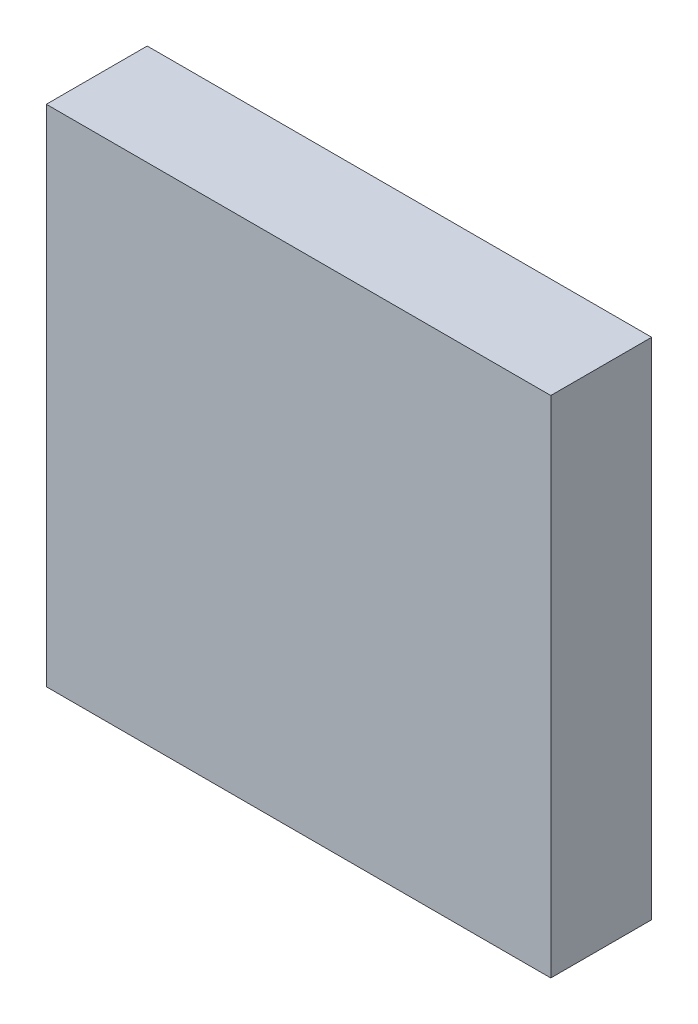
ISO-10303-21;
HEADER;
FILE_DESCRIPTION(('STEP AP214'),'2;1');
FILE_NAME('part.step','',(''),(''),'','','');
FILE_SCHEMA(('AUTOMOTIVE_DESIGN { 1 0 10303 214 1 1 1 1 }'));
ENDSEC;
DATA;
#1=APPLICATION_CONTEXT('core data for automotive mechanical design processes');
#2=APPLICATION_PROTOCOL_DEFINITION('international standard','automotive_design',2000,#1);
#3=PRODUCT_CONTEXT('',#1,'mechanical');
#4=PRODUCT('Part','Part','',(#3));
#5=PRODUCT_RELATED_PRODUCT_CATEGORY('part','',(#4));
#6=PRODUCT_DEFINITION_FORMATION('','',#4);
#7=PRODUCT_DEFINITION_CONTEXT('part definition',#1,'design');
#8=PRODUCT_DEFINITION('design','',#6,#7);
#9=PRODUCT_DEFINITION_SHAPE('','',#8);
#10=(LENGTH_UNIT() NAMED_UNIT(*) SI_UNIT(.MILLI.,.METRE.));
#11=(NAMED_UNIT(*) PLANE_ANGLE_UNIT() SI_UNIT($,.RADIAN.));
#12=(NAMED_UNIT(*) SI_UNIT($,.STERADIAN.) SOLID_ANGLE_UNIT());
#13=UNCERTAINTY_MEASURE_WITH_UNIT(LENGTH_MEASURE(1.E-05),#10,'distance_accuracy_value','');
#14=(GEOMETRIC_REPRESENTATION_CONTEXT(3) GLOBAL_UNCERTAINTY_ASSIGNED_CONTEXT((#13)) GLOBAL_UNIT_ASSIGNED_CONTEXT((#10,
#11,#12)) REPRESENTATION_CONTEXT('',''));
#15=CARTESIAN_POINT('',(0.,0.,0.));
#16=DIRECTION('',(0.,0.,1.));
#17=DIRECTION('',(1.,0.,0.));
#18=AXIS2_PLACEMENT_3D('',#15,#16,#17);
#19=CARTESIAN_POINT('',(-12.5,-12.5,5.));
#20=DIRECTION('',(0.,1.,0.));
#21=DIRECTION('',(-1.,0.,0.));
#22=AXIS2_PLACEMENT_3D('',#19,#20,#21);
#23=PLANE('',#22);
#24=DIRECTION('',(1.,0.,0.));
#25=VECTOR('',#24,1.);
#26=CARTESIAN_POINT('',(-12.5,-12.5,0.));
#27=LINE('',#26,#25);
#28=CARTESIAN_POINT('',(-12.5,-12.5,0.));
#29=VERTEX_POINT('',#28);
#30=CARTESIAN_POINT('',(12.5,-12.5,0.));
#31=VERTEX_POINT('',#30);
#32=EDGE_CURVE('E113',#29,#31,#27,.T.);
#33=ORIENTED_EDGE('',*,*,#32,.T.);
#34=DIRECTION('',(0.,0.,-1.));
#35=VECTOR('',#34,1.);
#36=CARTESIAN_POINT('',(12.5,-12.5,5.));
#37=LINE('',#36,#35);
#38=CARTESIAN_POINT('',(12.5,-12.5,5.));
#39=VERTEX_POINT('',#38);
#40=EDGE_CURVE('E11',#39,#31,#37,.T.);
#41=ORIENTED_EDGE('',*,*,#40,.F.);
#42=DIRECTION('',(1.,0.,0.));
#43=VECTOR('',#42,1.);
#44=CARTESIAN_POINT('',(-12.5,-12.5,5.));
#45=LINE('',#44,#43);
#46=CARTESIAN_POINT('',(-12.5,-12.5,5.));
#47=VERTEX_POINT('',#46);
#48=EDGE_CURVE('E97',#47,#39,#45,.T.);
#49=ORIENTED_EDGE('',*,*,#48,.F.);
#50=DIRECTION('',(0.,0.,-1.));
#51=VECTOR('',#50,1.);
#52=CARTESIAN_POINT('',(-12.5,-12.5,5.));
#53=LINE('',#52,#51);
#54=EDGE_CURVE('E109',#47,#29,#53,.T.);
#55=ORIENTED_EDGE('',*,*,#54,.T.);
#56=EDGE_LOOP('',(#33,#41,#49,#55));
#57=FACE_BOUND('',#56,.T.);
#58=ADVANCED_FACE('F45',(#57),#23,.F.);
#59=CARTESIAN_POINT('',(12.5,12.5,5.));
#60=DIRECTION('',(-1.,0.,0.));
#61=DIRECTION('',(0.,-1.,0.));
#62=AXIS2_PLACEMENT_3D('',#59,#60,#61);
#63=PLANE('',#62);
#64=DIRECTION('',(0.,1.,0.));
#65=VECTOR('',#64,1.);
#66=CARTESIAN_POINT('',(12.5,12.5,0.));
#67=LINE('',#66,#65);
#68=CARTESIAN_POINT('',(12.5,12.5,0.));
#69=VERTEX_POINT('',#68);
#70=EDGE_CURVE('E102',#31,#69,#67,.T.);
#71=ORIENTED_EDGE('',*,*,#70,.T.);
#72=DIRECTION('',(0.,0.,-1.));
#73=VECTOR('',#72,1.);
#74=CARTESIAN_POINT('',(12.5,12.5,5.));
#75=LINE('',#74,#73);
#76=CARTESIAN_POINT('',(12.5,12.5,5.));
#77=VERTEX_POINT('',#76);
#78=EDGE_CURVE('E54',#77,#69,#75,.T.);
#79=ORIENTED_EDGE('',*,*,#78,.F.);
#80=DIRECTION('',(0.,1.,0.));
#81=VECTOR('',#80,1.);
#82=CARTESIAN_POINT('',(12.5,12.5,5.));
#83=LINE('',#82,#81);
#84=EDGE_CURVE('E92',#39,#77,#83,.T.);
#85=ORIENTED_EDGE('',*,*,#84,.F.);
#86=ORIENTED_EDGE('',*,*,#40,.T.);
#87=EDGE_LOOP('',(#71,#79,#85,#86));
#88=FACE_BOUND('',#87,.T.);
#89=ADVANCED_FACE('F101',(#88),#63,.F.);
#90=CARTESIAN_POINT('',(-12.5,12.5,5.));
#91=DIRECTION('',(0.,-1.,0.));
#92=DIRECTION('',(1.,0.,0.));
#93=AXIS2_PLACEMENT_3D('',#90,#91,#92);
#94=PLANE('',#93);
#95=DIRECTION('',(-1.,0.,0.));
#96=VECTOR('',#95,1.);
#97=CARTESIAN_POINT('',(-12.5,12.5,0.));
#98=LINE('',#97,#96);
#99=CARTESIAN_POINT('',(-12.5,12.5,0.));
#100=VERTEX_POINT('',#99);
#101=EDGE_CURVE('E79',#69,#100,#98,.T.);
#102=ORIENTED_EDGE('',*,*,#101,.T.);
#103=DIRECTION('',(0.,0.,-1.));
#104=VECTOR('',#103,1.);
#105=CARTESIAN_POINT('',(-12.5,12.5,5.));
#106=LINE('',#105,#104);
#107=CARTESIAN_POINT('',(-12.5,12.5,5.));
#108=VERTEX_POINT('',#107);
#109=EDGE_CURVE('E104',#108,#100,#106,.T.);
#110=ORIENTED_EDGE('',*,*,#109,.F.);
#111=DIRECTION('',(-1.,0.,0.));
#112=VECTOR('',#111,1.);
#113=CARTESIAN_POINT('',(-12.5,12.5,5.));
#114=LINE('',#113,#112);
#115=EDGE_CURVE('E95',#77,#108,#114,.T.);
#116=ORIENTED_EDGE('',*,*,#115,.F.);
#117=ORIENTED_EDGE('',*,*,#78,.T.);
#118=EDGE_LOOP('',(#102,#110,#116,#117));
#119=FACE_BOUND('',#118,.T.);
#120=ADVANCED_FACE('F105',(#119),#94,.F.);
#121=CARTESIAN_POINT('',(-12.5,12.5,5.));
#122=DIRECTION('',(1.,0.,0.));
#123=DIRECTION('',(0.,1.,0.));
#124=AXIS2_PLACEMENT_3D('',#121,#122,#123);
#125=PLANE('',#124);
#126=DIRECTION('',(0.,-1.,0.));
#127=VECTOR('',#126,1.);
#128=CARTESIAN_POINT('',(-12.5,12.5,0.));
#129=LINE('',#128,#127);
#130=EDGE_CURVE('E85',#100,#29,#129,.T.);
#131=ORIENTED_EDGE('',*,*,#130,.T.);
#132=ORIENTED_EDGE('',*,*,#54,.F.);
#133=DIRECTION('',(0.,-1.,0.));
#134=VECTOR('',#133,1.);
#135=CARTESIAN_POINT('',(-12.5,12.5,5.));
#136=LINE('',#135,#134);
#137=EDGE_CURVE('E62',#108,#47,#136,.T.);
#138=ORIENTED_EDGE('',*,*,#137,.F.);
#139=ORIENTED_EDGE('',*,*,#109,.T.);
#140=EDGE_LOOP('',(#131,#132,#138,#139));
#141=FACE_BOUND('',#140,.T.);
#142=ADVANCED_FACE('F126',(#141),#125,.F.);
#143=CARTESIAN_POINT('',(0.,0.,5.));
#144=DIRECTION('',(0.,0.,-1.));
#145=DIRECTION('',(-1.,0.,0.));
#146=AXIS2_PLACEMENT_3D('',#143,#144,#145);
#147=PLANE('',#146);
#148=ORIENTED_EDGE('',*,*,#48,.T.);
#149=ORIENTED_EDGE('',*,*,#84,.T.);
#150=ORIENTED_EDGE('',*,*,#115,.T.);
#151=ORIENTED_EDGE('',*,*,#137,.T.);
#152=EDGE_LOOP('',(#148,#149,#150,#151));
#153=FACE_BOUND('',#152,.T.);
#154=ADVANCED_FACE('F93',(#153),#147,.F.);
#155=CARTESIAN_POINT('',(0.,0.,0.));
#156=DIRECTION('',(0.,0.,-1.));
#157=DIRECTION('',(-1.,0.,0.));
#158=AXIS2_PLACEMENT_3D('',#155,#156,#157);
#159=PLANE('',#158);
#160=ORIENTED_EDGE('',*,*,#32,.F.);
#161=ORIENTED_EDGE('',*,*,#130,.F.);
#162=ORIENTED_EDGE('',*,*,#101,.F.);
#163=ORIENTED_EDGE('',*,*,#70,.F.);
#164=EDGE_LOOP('',(#160,#161,#162,#163));
#165=FACE_BOUND('',#164,.T.);
#166=ADVANCED_FACE('F129',(#165),#159,.T.);
#167=CLOSED_SHELL('',(#58,#89,#120,#142,#154,#166));
#168=MANIFOLD_SOLID_BREP('B2',#167);
#169=ADVANCED_BREP_SHAPE_REPRESENTATION('',(#18,#168),#14);
#170=SHAPE_DEFINITION_REPRESENTATION(#9,#169);
ENDSEC;
END-ISO-10303-21;
